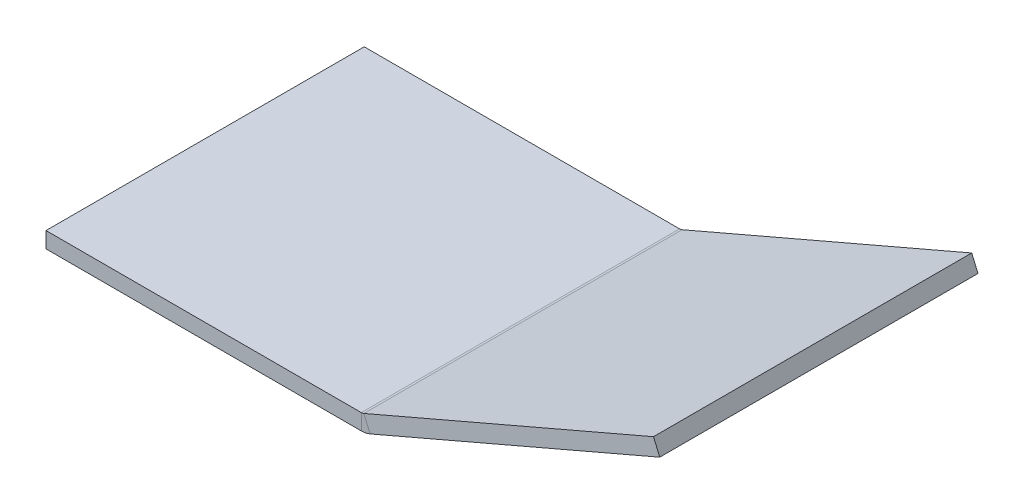
ISO-10303-21;
HEADER;
FILE_DESCRIPTION(('STEP AP214'),'2;1');
FILE_NAME('part.step','',(''),(''),'','','');
FILE_SCHEMA(('AUTOMOTIVE_DESIGN { 1 0 10303 214 1 1 1 1 }'));
ENDSEC;
DATA;
#1=APPLICATION_CONTEXT('core data for automotive mechanical design processes');
#2=APPLICATION_PROTOCOL_DEFINITION('international standard','automotive_design',2000,#1);
#3=PRODUCT_CONTEXT('',#1,'mechanical');
#4=PRODUCT('Part','Part','',(#3));
#5=PRODUCT_RELATED_PRODUCT_CATEGORY('part','',(#4));
#6=PRODUCT_DEFINITION_FORMATION('','',#4);
#7=PRODUCT_DEFINITION_CONTEXT('part definition',#1,'design');
#8=PRODUCT_DEFINITION('design','',#6,#7);
#9=PRODUCT_DEFINITION_SHAPE('','',#8);
#10=(LENGTH_UNIT() NAMED_UNIT(*) SI_UNIT(.MILLI.,.METRE.));
#11=(NAMED_UNIT(*) PLANE_ANGLE_UNIT() SI_UNIT($,.RADIAN.));
#12=(NAMED_UNIT(*) SI_UNIT($,.STERADIAN.) SOLID_ANGLE_UNIT());
#13=UNCERTAINTY_MEASURE_WITH_UNIT(LENGTH_MEASURE(1.E-05),#10,'distance_accuracy_value','');
#14=(GEOMETRIC_REPRESENTATION_CONTEXT(3) GLOBAL_UNCERTAINTY_ASSIGNED_CONTEXT((#13)) GLOBAL_UNIT_ASSIGNED_CONTEXT((#10,
#11,#12)) REPRESENTATION_CONTEXT('',''));
#15=CARTESIAN_POINT('',(0.,0.,0.));
#16=DIRECTION('',(0.,0.,1.));
#17=DIRECTION('',(1.,0.,0.));
#18=AXIS2_PLACEMENT_3D('',#15,#16,#17);
#19=CARTESIAN_POINT('',(-45.4192553739581,-22.1648726729081,-25.));
#20=DIRECTION('',(0.,0.,-1.));
#21=DIRECTION('',(-0.91851540306761,-0.395385197405702,0.));
#22=AXIS2_PLACEMENT_3D('',#19,#20,#21);
#23=PLANE('',#22);
#24=DIRECTION('',(-0.91851540306761,-0.395385197405702,0.));
#25=VECTOR('',#24,1.);
#26=CARTESIAN_POINT('',(-45.4192553739581,-22.1648726729081,-25.));
#27=LINE('',#26,#25);
#28=CARTESIAN_POINT('',(46.4322849328029,17.3736470676621,-25.));
#29=VERTEX_POINT('',#28);
#30=CARTESIAN_POINT('',(0.926550110281799,-2.21480391073663,-25.));
#31=VERTEX_POINT('',#30);
#32=EDGE_CURVE('E177',#29,#31,#27,.T.);
#33=ORIENTED_EDGE('',*,*,#32,.T.);
#34=DIRECTION('',(-0.395385197405702,0.91851540306761,0.));
#35=VECTOR('',#34,1.);
#36=CARTESIAN_POINT('',(0.926550110281799,-2.21480391073663,-25.));
#37=LINE('',#36,#35);
#38=CARTESIAN_POINT('',(-0.0619128832324569,0.08148459693239,-25.));
#39=VERTEX_POINT('',#38);
#40=EDGE_CURVE('E12',#31,#39,#37,.T.);
#41=ORIENTED_EDGE('',*,*,#40,.T.);
#42=DIRECTION('',(-0.91851540306761,-0.395385197405702,0.));
#43=VECTOR('',#42,1.);
#44=CARTESIAN_POINT('',(-46.4077183674724,-19.8685841652391,-25.));
#45=LINE('',#44,#43);
#46=CARTESIAN_POINT('',(45.4438219392886,19.6699355753311,-25.));
#47=VERTEX_POINT('',#46);
#48=EDGE_CURVE('E59',#47,#39,#45,.T.);
#49=ORIENTED_EDGE('',*,*,#48,.F.);
#50=DIRECTION('',(-0.395385197405702,0.91851540306761,0.));
#51=VECTOR('',#50,1.);
#52=CARTESIAN_POINT('',(46.4322849328029,17.3736470676621,-25.));
#53=LINE('',#52,#51);
#54=EDGE_CURVE('E133',#29,#47,#53,.T.);
#55=ORIENTED_EDGE('',*,*,#54,.F.);
#56=EDGE_LOOP('',(#33,#41,#49,#55));
#57=FACE_BOUND('',#56,.T.);
#58=ADVANCED_FACE('F43',(#57),#23,.T.);
#59=CARTESIAN_POINT('',(-45.4192553739581,-22.1648726729081,25.));
#60=DIRECTION('',(0.,0.,1.));
#61=DIRECTION('',(0.91851540306761,0.395385197405702,0.));
#62=AXIS2_PLACEMENT_3D('',#59,#60,#61);
#63=PLANE('',#62);
#64=DIRECTION('',(0.91851540306761,0.395385197405702,0.));
#65=VECTOR('',#64,1.);
#66=CARTESIAN_POINT('',(-46.4077183674723,-19.8685841652391,25.));
#67=LINE('',#66,#65);
#68=CARTESIAN_POINT('',(-0.0619128832324569,0.08148459693239,25.));
#69=VERTEX_POINT('',#68);
#70=CARTESIAN_POINT('',(45.4438219392886,19.6699355753311,25.));
#71=VERTEX_POINT('',#70);
#72=EDGE_CURVE('E66',#69,#71,#67,.T.);
#73=ORIENTED_EDGE('',*,*,#72,.F.);
#74=DIRECTION('',(0.395385197405702,-0.91851540306761,0.));
#75=VECTOR('',#74,1.);
#76=CARTESIAN_POINT('',(0.926550110281799,-2.21480391073663,25.));
#77=LINE('',#76,#75);
#78=CARTESIAN_POINT('',(0.926550110281799,-2.21480391073663,25.));
#79=VERTEX_POINT('',#78);
#80=EDGE_CURVE('E107',#69,#79,#77,.T.);
#81=ORIENTED_EDGE('',*,*,#80,.T.);
#82=DIRECTION('',(0.91851540306761,0.395385197405702,0.));
#83=VECTOR('',#82,1.);
#84=CARTESIAN_POINT('',(-45.4192553739581,-22.1648726729081,25.));
#85=LINE('',#84,#83);
#86=CARTESIAN_POINT('',(46.4322849328029,17.3736470676621,25.));
#87=VERTEX_POINT('',#86);
#88=EDGE_CURVE('E46',#79,#87,#85,.T.);
#89=ORIENTED_EDGE('',*,*,#88,.T.);
#90=DIRECTION('',(-0.395385197405702,0.91851540306761,0.));
#91=VECTOR('',#90,1.);
#92=CARTESIAN_POINT('',(46.4322849328029,17.3736470676621,25.));
#93=LINE('',#92,#91);
#94=EDGE_CURVE('E181',#87,#71,#93,.T.);
#95=ORIENTED_EDGE('',*,*,#94,.T.);
#96=EDGE_LOOP('',(#73,#81,#89,#95));
#97=FACE_BOUND('',#96,.T.);
#98=ADVANCED_FACE('F109',(#97),#63,.T.);
#99=CARTESIAN_POINT('',(-0.481948214091871,-0.0993242949539823,0.));
#100=DIRECTION('',(-0.395385197405702,0.91851540306761,0.));
#101=DIRECTION('',(0.,0.,1.));
#102=AXIS2_PLACEMENT_3D('',#99,#100,#101);
#103=PLANE('',#102);
#104=ORIENTED_EDGE('',*,*,#48,.T.);
#105=DIRECTION('',(0.,0.,1.));
#106=VECTOR('',#105,1.);
#107=CARTESIAN_POINT('',(-0.0619128832324562,0.0814845969323903,0.));
#108=LINE('',#107,#106);
#109=EDGE_CURVE('E51',#39,#69,#108,.T.);
#110=ORIENTED_EDGE('',*,*,#109,.T.);
#111=ORIENTED_EDGE('',*,*,#72,.T.);
#112=DIRECTION('',(0.,0.,-1.));
#113=VECTOR('',#112,1.);
#114=CARTESIAN_POINT('',(45.4438219392886,19.6699355753311,-25.));
#115=LINE('',#114,#113);
#116=EDGE_CURVE('E178',#71,#47,#115,.T.);
#117=ORIENTED_EDGE('',*,*,#116,.T.);
#118=EDGE_LOOP('',(#104,#110,#111,#117));
#119=FACE_BOUND('',#118,.T.);
#120=ADVANCED_FACE('F185',(#119),#103,.T.);
#121=CARTESIAN_POINT('',(46.4322849328029,17.3736470676621,-25.));
#122=DIRECTION('',(0.91851540306761,0.395385197405702,0.));
#123=DIRECTION('',(0.,0.,-1.));
#124=AXIS2_PLACEMENT_3D('',#121,#122,#123);
#125=PLANE('',#124);
#126=ORIENTED_EDGE('',*,*,#116,.F.);
#127=ORIENTED_EDGE('',*,*,#94,.F.);
#128=DIRECTION('',(0.,0.,-1.));
#129=VECTOR('',#128,1.);
#130=CARTESIAN_POINT('',(46.4322849328029,17.3736470676621,-25.));
#131=LINE('',#130,#129);
#132=EDGE_CURVE('E124',#87,#29,#131,.T.);
#133=ORIENTED_EDGE('',*,*,#132,.T.);
#134=ORIENTED_EDGE('',*,*,#54,.T.);
#135=EDGE_LOOP('',(#126,#127,#133,#134));
#136=FACE_BOUND('',#135,.T.);
#137=ADVANCED_FACE('F189',(#136),#125,.T.);
#138=CARTESIAN_POINT('',(0.506514779422385,-2.39561280262301,0.));
#139=DIRECTION('',(-0.395385197405702,0.91851540306761,0.));
#140=DIRECTION('',(0.,0.,1.));
#141=AXIS2_PLACEMENT_3D('',#138,#139,#140);
#142=PLANE('',#141);
#143=DIRECTION('',(0.,0.,1.));
#144=VECTOR('',#143,1.);
#145=CARTESIAN_POINT('',(0.9265501102818,-2.21480391073663,0.));
#146=LINE('',#145,#144);
#147=EDGE_CURVE('E115',#31,#79,#146,.T.);
#148=ORIENTED_EDGE('',*,*,#147,.F.);
#149=ORIENTED_EDGE('',*,*,#32,.F.);
#150=ORIENTED_EDGE('',*,*,#132,.F.);
#151=ORIENTED_EDGE('',*,*,#88,.F.);
#152=EDGE_LOOP('',(#148,#149,#150,#151));
#153=FACE_BOUND('',#152,.T.);
#154=ADVANCED_FACE('F120',(#153),#142,.F.);
#155=CARTESIAN_POINT('',(-50.,-2.5,-25.));
#156=DIRECTION('',(-1.,0.,0.));
#157=DIRECTION('',(0.,0.,1.));
#158=AXIS2_PLACEMENT_3D('',#155,#156,#157);
#159=PLANE('',#158);
#160=DIRECTION('',(0.,0.,1.));
#161=VECTOR('',#160,1.);
#162=CARTESIAN_POINT('',(-50.,0.,-25.));
#163=LINE('',#162,#161);
#164=CARTESIAN_POINT('',(-50.,0.,-25.));
#165=VERTEX_POINT('',#164);
#166=CARTESIAN_POINT('',(-50.,0.,25.));
#167=VERTEX_POINT('',#166);
#168=EDGE_CURVE('E158',#165,#167,#163,.T.);
#169=ORIENTED_EDGE('',*,*,#168,.F.);
#170=DIRECTION('',(0.,1.,0.));
#171=VECTOR('',#170,1.);
#172=CARTESIAN_POINT('',(-50.,-2.5,-25.));
#173=LINE('',#172,#171);
#174=CARTESIAN_POINT('',(-50.,-2.5,-25.));
#175=VERTEX_POINT('',#174);
#176=EDGE_CURVE('E151',#175,#165,#173,.T.);
#177=ORIENTED_EDGE('',*,*,#176,.F.);
#178=DIRECTION('',(0.,0.,1.));
#179=VECTOR('',#178,1.);
#180=CARTESIAN_POINT('',(-50.,-2.5,-25.));
#181=LINE('',#180,#179);
#182=CARTESIAN_POINT('',(-50.,-2.5,25.));
#183=VERTEX_POINT('',#182);
#184=EDGE_CURVE('E170',#175,#183,#181,.T.);
#185=ORIENTED_EDGE('',*,*,#184,.T.);
#186=DIRECTION('',(0.,1.,0.));
#187=VECTOR('',#186,1.);
#188=CARTESIAN_POINT('',(-50.,-2.5,25.));
#189=LINE('',#188,#187);
#190=EDGE_CURVE('E168',#183,#167,#189,.T.);
#191=ORIENTED_EDGE('',*,*,#190,.T.);
#192=EDGE_LOOP('',(#169,#177,#185,#191));
#193=FACE_BOUND('',#192,.T.);
#194=ADVANCED_FACE('F213',(#193),#159,.T.);
#195=CARTESIAN_POINT('',(0.,-2.5,0.));
#196=DIRECTION('',(0.,1.,0.));
#197=DIRECTION('',(0.,0.,1.));
#198=AXIS2_PLACEMENT_3D('',#195,#196,#197);
#199=PLANE('',#198);
#200=DIRECTION('',(-1.,0.,0.));
#201=VECTOR('',#200,1.);
#202=CARTESIAN_POINT('',(-50.,-2.5,-25.));
#203=LINE('',#202,#201);
#204=CARTESIAN_POINT('',(-0.457298080638158,-2.5,-25.));
#205=VERTEX_POINT('',#204);
#206=EDGE_CURVE('E154',#205,#175,#203,.T.);
#207=ORIENTED_EDGE('',*,*,#206,.F.);
#208=DIRECTION('',(0.,0.,1.));
#209=VECTOR('',#208,1.);
#210=CARTESIAN_POINT('',(-0.457298080638158,-2.5,0.));
#211=LINE('',#210,#209);
#212=CARTESIAN_POINT('',(-0.457298080638159,-2.5,25.));
#213=VERTEX_POINT('',#212);
#214=EDGE_CURVE('E165',#205,#213,#211,.T.);
#215=ORIENTED_EDGE('',*,*,#214,.T.);
#216=DIRECTION('',(1.,0.,0.));
#217=VECTOR('',#216,1.);
#218=CARTESIAN_POINT('',(-50.,-2.5,25.));
#219=LINE('',#218,#217);
#220=EDGE_CURVE('E163',#183,#213,#219,.T.);
#221=ORIENTED_EDGE('',*,*,#220,.F.);
#222=ORIENTED_EDGE('',*,*,#184,.F.);
#223=EDGE_LOOP('',(#207,#215,#221,#222));
#224=FACE_BOUND('',#223,.T.);
#225=ADVANCED_FACE('F211',(#224),#199,.F.);
#226=CARTESIAN_POINT('',(-50.,-2.5,25.));
#227=DIRECTION('',(0.,0.,1.));
#228=DIRECTION('',(1.,0.,0.));
#229=AXIS2_PLACEMENT_3D('',#226,#227,#228);
#230=PLANE('',#229);
#231=DIRECTION('',(0.,-1.,0.));
#232=VECTOR('',#231,1.);
#233=CARTESIAN_POINT('',(-0.457298080638158,-2.5,25.));
#234=LINE('',#233,#232);
#235=CARTESIAN_POINT('',(-0.457298080638158,0.,25.));
#236=VERTEX_POINT('',#235);
#237=EDGE_CURVE('E138',#236,#213,#234,.T.);
#238=ORIENTED_EDGE('',*,*,#237,.F.);
#239=DIRECTION('',(1.,0.,0.));
#240=VECTOR('',#239,1.);
#241=CARTESIAN_POINT('',(-50.,0.,25.));
#242=LINE('',#241,#240);
#243=EDGE_CURVE('E156',#167,#236,#242,.T.);
#244=ORIENTED_EDGE('',*,*,#243,.F.);
#245=ORIENTED_EDGE('',*,*,#190,.F.);
#246=ORIENTED_EDGE('',*,*,#220,.T.);
#247=EDGE_LOOP('',(#238,#244,#245,#246));
#248=FACE_BOUND('',#247,.T.);
#249=ADVANCED_FACE('F207',(#248),#230,.T.);
#250=CARTESIAN_POINT('',(0.,0.,0.));
#251=DIRECTION('',(0.,1.,0.));
#252=DIRECTION('',(0.,0.,1.));
#253=AXIS2_PLACEMENT_3D('',#250,#251,#252);
#254=PLANE('',#253);
#255=DIRECTION('',(0.,0.,1.));
#256=VECTOR('',#255,1.);
#257=CARTESIAN_POINT('',(-0.457298080638158,0.,0.));
#258=LINE('',#257,#256);
#259=CARTESIAN_POINT('',(-0.457298080638158,0.,-25.));
#260=VERTEX_POINT('',#259);
#261=EDGE_CURVE('E142',#260,#236,#258,.T.);
#262=ORIENTED_EDGE('',*,*,#261,.F.);
#263=DIRECTION('',(-1.,0.,0.));
#264=VECTOR('',#263,1.);
#265=CARTESIAN_POINT('',(-50.,0.,-25.));
#266=LINE('',#265,#264);
#267=EDGE_CURVE('E161',#260,#165,#266,.T.);
#268=ORIENTED_EDGE('',*,*,#267,.T.);
#269=ORIENTED_EDGE('',*,*,#168,.T.);
#270=ORIENTED_EDGE('',*,*,#243,.T.);
#271=EDGE_LOOP('',(#262,#268,#269,#270));
#272=FACE_BOUND('',#271,.T.);
#273=ADVANCED_FACE('F204',(#272),#254,.T.);
#274=CARTESIAN_POINT('',(-50.,-2.5,-25.));
#275=DIRECTION('',(0.,0.,-1.));
#276=DIRECTION('',(-1.,0.,0.));
#277=AXIS2_PLACEMENT_3D('',#274,#275,#276);
#278=PLANE('',#277);
#279=DIRECTION('',(0.,1.,0.));
#280=VECTOR('',#279,1.);
#281=CARTESIAN_POINT('',(-0.457298080638158,-2.5,-25.));
#282=LINE('',#281,#280);
#283=EDGE_CURVE('E139',#205,#260,#282,.T.);
#284=ORIENTED_EDGE('',*,*,#283,.F.);
#285=ORIENTED_EDGE('',*,*,#206,.T.);
#286=ORIENTED_EDGE('',*,*,#176,.T.);
#287=ORIENTED_EDGE('',*,*,#267,.F.);
#288=EDGE_LOOP('',(#284,#285,#286,#287));
#289=FACE_BOUND('',#288,.T.);
#290=ADVANCED_FACE('F199',(#289),#278,.T.);
#291=CARTESIAN_POINT('',(-0.457298080638158,1.,-25.));
#292=DIRECTION('',(0.,0.,-1.));
#293=DIRECTION('',(-1.,0.,0.));
#294=AXIS2_PLACEMENT_3D('',#291,#292,#293);
#295=PLANE('',#294);
#296=ORIENTED_EDGE('',*,*,#283,.T.);
#297=CARTESIAN_POINT('',(-0.457298080638158,1.,-25.));
#298=DIRECTION('',(0.,0.,1.));
#299=DIRECTION('',(1.,0.,0.));
#300=AXIS2_PLACEMENT_3D('',#297,#298,#299);
#301=CIRCLE('',#300,1.);
#302=EDGE_CURVE('E148',#260,#39,#301,.T.);
#303=ORIENTED_EDGE('',*,*,#302,.T.);
#304=ORIENTED_EDGE('',*,*,#40,.F.);
#305=CARTESIAN_POINT('',(-0.457298080638158,1.,-25.));
#306=DIRECTION('',(0.,0.,1.));
#307=DIRECTION('',(-1.,0.,0.));
#308=AXIS2_PLACEMENT_3D('',#305,#306,#307);
#309=CIRCLE('',#308,3.5);
#310=EDGE_CURVE('E132',#205,#31,#309,.T.);
#311=ORIENTED_EDGE('',*,*,#310,.F.);
#312=EDGE_LOOP('',(#296,#303,#304,#311));
#313=FACE_BOUND('',#312,.T.);
#314=ADVANCED_FACE('F196',(#313),#295,.T.);
#315=CARTESIAN_POINT('',(-0.457298080638158,1.,25.));
#316=DIRECTION('',(0.,0.,1.));
#317=DIRECTION('',(1.,0.,0.));
#318=AXIS2_PLACEMENT_3D('',#315,#316,#317);
#319=PLANE('',#318);
#320=ORIENTED_EDGE('',*,*,#80,.F.);
#321=CARTESIAN_POINT('',(-0.457298080638158,1.,25.));
#322=DIRECTION('',(0.,0.,1.));
#323=DIRECTION('',(1.,0.,0.));
#324=AXIS2_PLACEMENT_3D('',#321,#322,#323);
#325=CIRCLE('',#324,1.);
#326=EDGE_CURVE('E144',#69,#236,#325,.F.);
#327=ORIENTED_EDGE('',*,*,#326,.T.);
#328=ORIENTED_EDGE('',*,*,#237,.T.);
#329=CARTESIAN_POINT('',(-0.457298080638158,1.,25.));
#330=DIRECTION('',(0.,0.,-1.));
#331=DIRECTION('',(1.,0.,0.));
#332=AXIS2_PLACEMENT_3D('',#329,#330,#331);
#333=CIRCLE('',#332,3.5);
#334=EDGE_CURVE('E130',#79,#213,#333,.T.);
#335=ORIENTED_EDGE('',*,*,#334,.F.);
#336=EDGE_LOOP('',(#320,#327,#328,#335));
#337=FACE_BOUND('',#336,.T.);
#338=ADVANCED_FACE('F136',(#337),#319,.T.);
#339=CARTESIAN_POINT('',(-0.457298080638158,1.,-50.0708147141448));
#340=DIRECTION('',(0.,0.,1.));
#341=DIRECTION('',(1.,0.,0.));
#342=AXIS2_PLACEMENT_3D('',#339,#340,#341);
#343=CYLINDRICAL_SURFACE('',#342,3.5);
#344=ORIENTED_EDGE('',*,*,#334,.T.);
#345=ORIENTED_EDGE('',*,*,#214,.F.);
#346=ORIENTED_EDGE('',*,*,#310,.T.);
#347=ORIENTED_EDGE('',*,*,#147,.T.);
#348=EDGE_LOOP('',(#344,#345,#346,#347));
#349=FACE_BOUND('',#348,.T.);
#350=ADVANCED_FACE('F128',(#349),#343,.T.);
#351=CARTESIAN_POINT('',(-0.457298080638158,1.,-50.0708147141448));
#352=DIRECTION('',(0.,0.,1.));
#353=DIRECTION('',(1.,0.,0.));
#354=AXIS2_PLACEMENT_3D('',#351,#352,#353);
#355=CYLINDRICAL_SURFACE('',#354,1.);
#356=ORIENTED_EDGE('',*,*,#326,.F.);
#357=ORIENTED_EDGE('',*,*,#109,.F.);
#358=ORIENTED_EDGE('',*,*,#302,.F.);
#359=ORIENTED_EDGE('',*,*,#261,.T.);
#360=EDGE_LOOP('',(#356,#357,#358,#359));
#361=FACE_BOUND('',#360,.T.);
#362=ADVANCED_FACE('F195',(#361),#355,.F.);
#363=CLOSED_SHELL('',(#58,#98,#120,#137,#154,#194,#225,#249,#273,#290,#314,#338,#350,#362));
#364=MANIFOLD_SOLID_BREP('B2',#363);
#365=ADVANCED_BREP_SHAPE_REPRESENTATION('',(#18,#364),#14);
#366=SHAPE_DEFINITION_REPRESENTATION(#9,#365);
ENDSEC;
END-ISO-10303-21;
